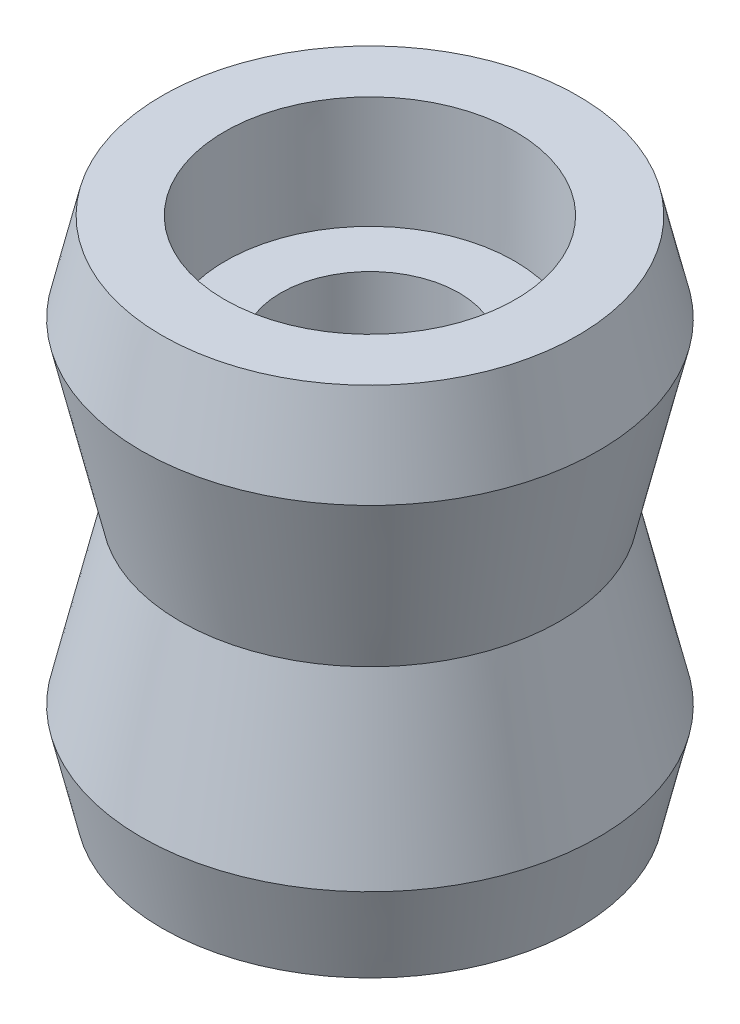
ISO-10303-21;
HEADER;
FILE_DESCRIPTION(('STEP AP214'),'2;1');
FILE_NAME('part.step','',(''),(''),'','','');
FILE_SCHEMA(('AUTOMOTIVE_DESIGN { 1 0 10303 214 1 1 1 1 }'));
ENDSEC;
DATA;
#1=APPLICATION_CONTEXT('core data for automotive mechanical design processes');
#2=APPLICATION_PROTOCOL_DEFINITION('international standard','automotive_design',2000,#1);
#3=PRODUCT_CONTEXT('',#1,'mechanical');
#4=PRODUCT('Part','Part','',(#3));
#5=PRODUCT_RELATED_PRODUCT_CATEGORY('part','',(#4));
#6=PRODUCT_DEFINITION_FORMATION('','',#4);
#7=PRODUCT_DEFINITION_CONTEXT('part definition',#1,'design');
#8=PRODUCT_DEFINITION('design','',#6,#7);
#9=PRODUCT_DEFINITION_SHAPE('','',#8);
#10=(LENGTH_UNIT() NAMED_UNIT(*) SI_UNIT(.MILLI.,.METRE.));
#11=(NAMED_UNIT(*) PLANE_ANGLE_UNIT() SI_UNIT($,.RADIAN.));
#12=(NAMED_UNIT(*) SI_UNIT($,.STERADIAN.) SOLID_ANGLE_UNIT());
#13=UNCERTAINTY_MEASURE_WITH_UNIT(LENGTH_MEASURE(1.E-05),#10,'distance_accuracy_value','');
#14=(GEOMETRIC_REPRESENTATION_CONTEXT(3) GLOBAL_UNCERTAINTY_ASSIGNED_CONTEXT((#13)) GLOBAL_UNIT_ASSIGNED_CONTEXT((#10,
#11,#12)) REPRESENTATION_CONTEXT('',''));
#15=CARTESIAN_POINT('',(0.,0.,0.));
#16=DIRECTION('',(0.,0.,1.));
#17=DIRECTION('',(1.,0.,0.));
#18=AXIS2_PLACEMENT_3D('',#15,#16,#17);
#19=CARTESIAN_POINT('',(0.,42.3234558477177,0.));
#20=DIRECTION('',(0.,1.,0.));
#21=DIRECTION('',(0.,0.,1.));
#22=AXIS2_PLACEMENT_3D('',#19,#20,#21);
#23=CYLINDRICAL_SURFACE('',#22,4.);
#24=CARTESIAN_POINT('',(0.,9.69817278431172,0.));
#25=DIRECTION('',(0.,1.,0.));
#26=DIRECTION('',(0.,0.,1.));
#27=AXIS2_PLACEMENT_3D('',#24,#25,#26);
#28=CIRCLE('',#27,4.);
#29=CARTESIAN_POINT('',(0.,9.69817278431172,4.));
#30=VERTEX_POINT('',#29);
#31=EDGE_CURVE('E38',#30,#30,#28,.T.);
#32=ORIENTED_EDGE('',*,*,#31,.T.);
#33=EDGE_LOOP('',(#32));
#34=FACE_BOUND('',#33,.T.);
#35=CARTESIAN_POINT('',(0.,-3.11353922112934,0.));
#36=DIRECTION('',(0.,-1.,0.));
#37=DIRECTION('',(0.,0.,-1.));
#38=AXIS2_PLACEMENT_3D('',#35,#36,#37);
#39=CIRCLE('',#38,4.);
#40=CARTESIAN_POINT('',(0.,-3.11353922112934,-4.));
#41=VERTEX_POINT('',#40);
#42=EDGE_CURVE('E10',#41,#41,#39,.F.);
#43=ORIENTED_EDGE('',*,*,#42,.F.);
#44=EDGE_LOOP('',(#43));
#45=FACE_BOUND('',#44,.T.);
#46=ADVANCED_FACE('F31',(#34,#45),#23,.F.);
#47=CARTESIAN_POINT('',(4.,9.69817278431172,0.));
#48=DIRECTION('',(0.,-1.,0.));
#49=DIRECTION('',(0.,0.,-1.));
#50=AXIS2_PLACEMENT_3D('',#47,#48,#49);
#51=PLANE('',#50);
#52=ORIENTED_EDGE('',*,*,#31,.F.);
#53=EDGE_LOOP('',(#52));
#54=FACE_BOUND('',#53,.T.);
#55=CARTESIAN_POINT('',(0.,9.69817278431171,0.));
#56=DIRECTION('',(0.,1.,0.));
#57=DIRECTION('',(0.,0.,1.));
#58=AXIS2_PLACEMENT_3D('',#55,#56,#57);
#59=CIRCLE('',#58,6.48);
#60=CARTESIAN_POINT('',(0.,9.69817278431171,6.48));
#61=VERTEX_POINT('',#60);
#62=EDGE_CURVE('E69',#61,#61,#59,.T.);
#63=ORIENTED_EDGE('',*,*,#62,.T.);
#64=EDGE_LOOP('',(#63));
#65=FACE_BOUND('',#64,.T.);
#66=ADVANCED_FACE('F33',(#54,#65),#51,.F.);
#67=CARTESIAN_POINT('',(4.,-3.31353922112934,0.));
#68=DIRECTION('',(0.,1.,0.));
#69=DIRECTION('',(0.,0.,1.));
#70=AXIS2_PLACEMENT_3D('',#67,#68,#69);
#71=PLANE('',#70);
#72=CARTESIAN_POINT('',(0.,-3.31353922112934,0.));
#73=DIRECTION('',(0.,1.,0.));
#74=DIRECTION('',(0.,0.,1.));
#75=AXIS2_PLACEMENT_3D('',#72,#73,#74);
#76=CIRCLE('',#75,6.48);
#77=CARTESIAN_POINT('',(0.,-3.31353922112934,6.48));
#78=VERTEX_POINT('',#77);
#79=EDGE_CURVE('E42',#78,#78,#76,.T.);
#80=ORIENTED_EDGE('',*,*,#79,.F.);
#81=EDGE_LOOP('',(#80));
#82=FACE_BOUND('',#81,.T.);
#83=ADVANCED_FACE('F120',(#82),#71,.F.);
#84=CARTESIAN_POINT('',(0.,-3.31353922112934,0.));
#85=DIRECTION('',(0.,-1.,0.));
#86=DIRECTION('',(0.,0.,-1.));
#87=AXIS2_PLACEMENT_3D('',#84,#85,#86);
#88=CONICAL_SURFACE('',#87,6.48,0.00799982933988701);
#89=CARTESIAN_POINT('',(0.,-8.31353922112934,0.));
#90=DIRECTION('',(0.,1.,0.));
#91=DIRECTION('',(0.,0.,1.));
#92=AXIS2_PLACEMENT_3D('',#89,#90,#91);
#93=CIRCLE('',#92,6.52);
#94=CARTESIAN_POINT('',(0.,-8.31353922112934,6.52));
#95=VERTEX_POINT('',#94);
#96=EDGE_CURVE('E46',#95,#95,#93,.T.);
#97=ORIENTED_EDGE('',*,*,#96,.F.);
#98=EDGE_LOOP('',(#97));
#99=FACE_BOUND('',#98,.T.);
#100=ORIENTED_EDGE('',*,*,#79,.T.);
#101=EDGE_LOOP('',(#100));
#102=FACE_BOUND('',#101,.T.);
#103=ADVANCED_FACE('F114',(#99,#102),#88,.F.);
#104=CARTESIAN_POINT('',(6.52,-8.31353922112934,0.));
#105=DIRECTION('',(0.,1.,0.));
#106=DIRECTION('',(0.,0.,1.));
#107=AXIS2_PLACEMENT_3D('',#104,#105,#106);
#108=PLANE('',#107);
#109=CARTESIAN_POINT('',(0.,-8.31353922112934,0.));
#110=DIRECTION('',(0.,1.,0.));
#111=DIRECTION('',(0.,0.,1.));
#112=AXIS2_PLACEMENT_3D('',#109,#110,#111);
#113=CIRCLE('',#112,9.31559679316632);
#114=CARTESIAN_POINT('',(0.,-8.31353922112934,9.31559679316632));
#115=VERTEX_POINT('',#114);
#116=EDGE_CURVE('E51',#115,#115,#113,.T.);
#117=ORIENTED_EDGE('',*,*,#116,.F.);
#118=EDGE_LOOP('',(#117));
#119=FACE_BOUND('',#118,.T.);
#120=ORIENTED_EDGE('',*,*,#96,.T.);
#121=EDGE_LOOP('',(#120));
#122=FACE_BOUND('',#121,.T.);
#123=ADVANCED_FACE('F108',(#119,#122),#108,.F.);
#124=CARTESIAN_POINT('',(0.,-8.31353922112934,0.));
#125=DIRECTION('',(0.,1.,0.));
#126=DIRECTION('',(0.,0.,1.));
#127=AXIS2_PLACEMENT_3D('',#124,#125,#126);
#128=CONICAL_SURFACE('',#127,9.31559679316632,0.229161730786861);
#129=CARTESIAN_POINT('',(0.,-4.30768321840881,0.));
#130=DIRECTION('',(0.,1.,0.));
#131=DIRECTION('',(0.,0.,1.));
#132=AXIS2_PLACEMENT_3D('',#129,#130,#131);
#133=CIRCLE('',#132,10.25);
#134=CARTESIAN_POINT('',(0.,-4.30768321840881,10.25));
#135=VERTEX_POINT('',#134);
#136=EDGE_CURVE('E54',#135,#135,#133,.T.);
#137=ORIENTED_EDGE('',*,*,#136,.F.);
#138=EDGE_LOOP('',(#137));
#139=FACE_BOUND('',#138,.T.);
#140=ORIENTED_EDGE('',*,*,#116,.T.);
#141=EDGE_LOOP('',(#140));
#142=FACE_BOUND('',#141,.T.);
#143=ADVANCED_FACE('F102',(#139,#142),#128,.T.);
#144=CARTESIAN_POINT('',(0.,-4.30768321840881,0.));
#145=DIRECTION('',(0.,-1.,0.));
#146=DIRECTION('',(0.,0.,-1.));
#147=AXIS2_PLACEMENT_3D('',#144,#145,#146);
#148=CONICAL_SURFACE('',#147,10.25,0.229231933276996);
#149=CARTESIAN_POINT('',(0.,3.19231678159119,0.));
#150=DIRECTION('',(0.,1.,0.));
#151=DIRECTION('',(0.,0.,1.));
#152=AXIS2_PLACEMENT_3D('',#149,#150,#151);
#153=CIRCLE('',#152,8.5);
#154=CARTESIAN_POINT('',(0.,3.19231678159119,8.5));
#155=VERTEX_POINT('',#154);
#156=EDGE_CURVE('E57',#155,#155,#153,.T.);
#157=ORIENTED_EDGE('',*,*,#156,.F.);
#158=EDGE_LOOP('',(#157));
#159=FACE_BOUND('',#158,.T.);
#160=ORIENTED_EDGE('',*,*,#136,.T.);
#161=EDGE_LOOP('',(#160));
#162=FACE_BOUND('',#161,.T.);
#163=ADVANCED_FACE('F96',(#159,#162),#148,.T.);
#164=CARTESIAN_POINT('',(0.,3.19231678159119,0.));
#165=DIRECTION('',(0.,1.,0.));
#166=DIRECTION('',(0.,0.,1.));
#167=AXIS2_PLACEMENT_3D('',#164,#165,#166);
#168=CONICAL_SURFACE('',#167,8.5,0.229231933276996);
#169=CARTESIAN_POINT('',(0.,10.6923167815912,0.));
#170=DIRECTION('',(0.,1.,0.));
#171=DIRECTION('',(0.,0.,1.));
#172=AXIS2_PLACEMENT_3D('',#169,#170,#171);
#173=CIRCLE('',#172,10.25);
#174=CARTESIAN_POINT('',(0.,10.6923167815912,10.25));
#175=VERTEX_POINT('',#174);
#176=EDGE_CURVE('E60',#175,#175,#173,.T.);
#177=ORIENTED_EDGE('',*,*,#176,.F.);
#178=EDGE_LOOP('',(#177));
#179=FACE_BOUND('',#178,.T.);
#180=ORIENTED_EDGE('',*,*,#156,.T.);
#181=EDGE_LOOP('',(#180));
#182=FACE_BOUND('',#181,.T.);
#183=ADVANCED_FACE('F90',(#179,#182),#168,.T.);
#184=CARTESIAN_POINT('',(0.,10.6923167815912,0.));
#185=DIRECTION('',(0.,-1.,0.));
#186=DIRECTION('',(0.,0.,-1.));
#187=AXIS2_PLACEMENT_3D('',#184,#185,#186);
#188=CONICAL_SURFACE('',#187,10.25,0.229161730786861);
#189=CARTESIAN_POINT('',(0.,14.6981727843117,0.));
#190=DIRECTION('',(0.,1.,0.));
#191=DIRECTION('',(0.,0.,1.));
#192=AXIS2_PLACEMENT_3D('',#189,#190,#191);
#193=CIRCLE('',#192,9.31559679316632);
#194=CARTESIAN_POINT('',(0.,14.6981727843117,9.31559679316632));
#195=VERTEX_POINT('',#194);
#196=EDGE_CURVE('E63',#195,#195,#193,.T.);
#197=ORIENTED_EDGE('',*,*,#196,.F.);
#198=EDGE_LOOP('',(#197));
#199=FACE_BOUND('',#198,.T.);
#200=ORIENTED_EDGE('',*,*,#176,.T.);
#201=EDGE_LOOP('',(#200));
#202=FACE_BOUND('',#201,.T.);
#203=ADVANCED_FACE('F84',(#199,#202),#188,.T.);
#204=CARTESIAN_POINT('',(6.52,14.6981727843117,0.));
#205=DIRECTION('',(0.,-1.,0.));
#206=DIRECTION('',(0.,0.,-1.));
#207=AXIS2_PLACEMENT_3D('',#204,#205,#206);
#208=PLANE('',#207);
#209=CARTESIAN_POINT('',(0.,14.6981727843117,0.));
#210=DIRECTION('',(0.,1.,0.));
#211=DIRECTION('',(0.,0.,1.));
#212=AXIS2_PLACEMENT_3D('',#209,#210,#211);
#213=CIRCLE('',#212,6.52);
#214=CARTESIAN_POINT('',(0.,14.6981727843117,6.52));
#215=VERTEX_POINT('',#214);
#216=EDGE_CURVE('E66',#215,#215,#213,.T.);
#217=ORIENTED_EDGE('',*,*,#216,.F.);
#218=EDGE_LOOP('',(#217));
#219=FACE_BOUND('',#218,.T.);
#220=ORIENTED_EDGE('',*,*,#196,.T.);
#221=EDGE_LOOP('',(#220));
#222=FACE_BOUND('',#221,.T.);
#223=ADVANCED_FACE('F78',(#219,#222),#208,.F.);
#224=CARTESIAN_POINT('',(0.,14.6981727843117,0.));
#225=DIRECTION('',(0.,1.,0.));
#226=DIRECTION('',(0.,0.,1.));
#227=AXIS2_PLACEMENT_3D('',#224,#225,#226);
#228=CONICAL_SURFACE('',#227,6.52,0.007999829339887);
#229=ORIENTED_EDGE('',*,*,#62,.F.);
#230=EDGE_LOOP('',(#229));
#231=FACE_BOUND('',#230,.T.);
#232=ORIENTED_EDGE('',*,*,#216,.T.);
#233=EDGE_LOOP('',(#232));
#234=FACE_BOUND('',#233,.T.);
#235=ADVANCED_FACE('F74',(#231,#234),#228,.F.);
#236=CARTESIAN_POINT('',(0.,-3.11353922112934,0.));
#237=DIRECTION('',(0.,-1.,0.));
#238=DIRECTION('',(0.,0.,-1.));
#239=AXIS2_PLACEMENT_3D('',#236,#237,#238);
#240=PLANE('',#239);
#241=ORIENTED_EDGE('',*,*,#42,.T.);
#242=EDGE_LOOP('',(#241));
#243=FACE_BOUND('',#242,.T.);
#244=ADVANCED_FACE('F77',(#243),#240,.F.);
#245=CLOSED_SHELL('',(#46,#66,#83,#103,#123,#143,#163,#183,#203,#223,#235,#244));
#246=MANIFOLD_SOLID_BREP('B2',#245);
#247=ADVANCED_BREP_SHAPE_REPRESENTATION('',(#18,#246),#14);
#248=SHAPE_DEFINITION_REPRESENTATION(#9,#247);
ENDSEC;
END-ISO-10303-21;
